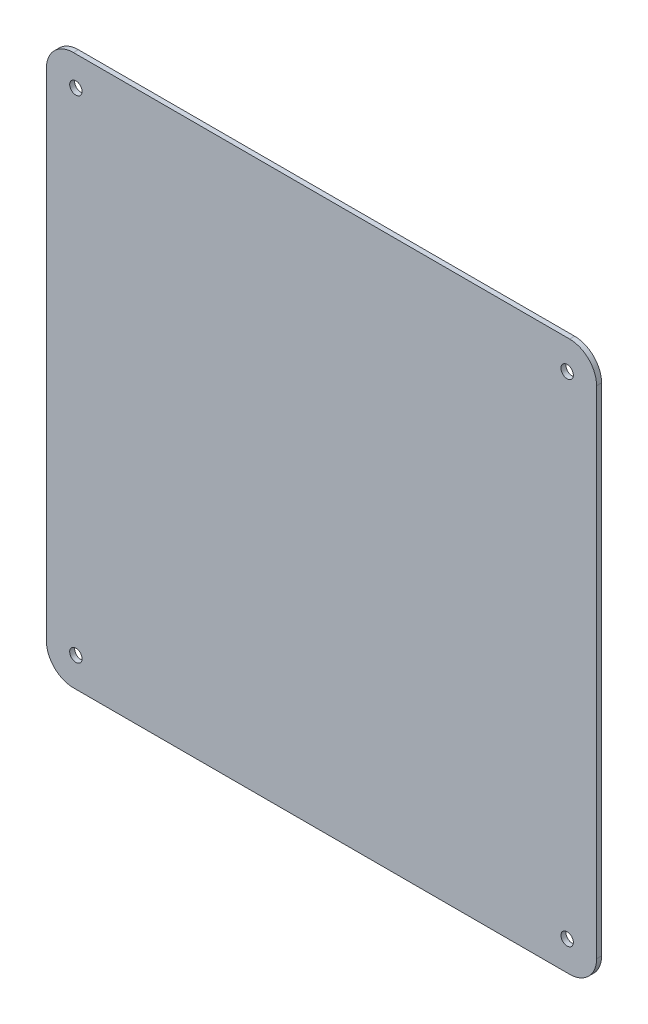
ISO-10303-21;
HEADER;
FILE_DESCRIPTION(('STEP AP214'),'2;1');
FILE_NAME('part.step','',(''),(''),'','','');
FILE_SCHEMA(('AUTOMOTIVE_DESIGN { 1 0 10303 214 1 1 1 1 }'));
ENDSEC;
DATA;
#1=APPLICATION_CONTEXT('core data for automotive mechanical design processes');
#2=APPLICATION_PROTOCOL_DEFINITION('international standard','automotive_design',2000,#1);
#3=PRODUCT_CONTEXT('',#1,'mechanical');
#4=PRODUCT('Part','Part','',(#3));
#5=PRODUCT_RELATED_PRODUCT_CATEGORY('part','',(#4));
#6=PRODUCT_DEFINITION_FORMATION('','',#4);
#7=PRODUCT_DEFINITION_CONTEXT('part definition',#1,'design');
#8=PRODUCT_DEFINITION('design','',#6,#7);
#9=PRODUCT_DEFINITION_SHAPE('','',#8);
#10=(LENGTH_UNIT() NAMED_UNIT(*) SI_UNIT(.MILLI.,.METRE.));
#11=(NAMED_UNIT(*) PLANE_ANGLE_UNIT() SI_UNIT($,.RADIAN.));
#12=(NAMED_UNIT(*) SI_UNIT($,.STERADIAN.) SOLID_ANGLE_UNIT());
#13=UNCERTAINTY_MEASURE_WITH_UNIT(LENGTH_MEASURE(1.E-05),#10,'distance_accuracy_value','');
#14=(GEOMETRIC_REPRESENTATION_CONTEXT(3) GLOBAL_UNCERTAINTY_ASSIGNED_CONTEXT((#13)) GLOBAL_UNIT_ASSIGNED_CONTEXT((#10,
#11,#12)) REPRESENTATION_CONTEXT('',''));
#15=CARTESIAN_POINT('',(0.,0.,0.));
#16=DIRECTION('',(0.,0.,1.));
#17=DIRECTION('',(1.,0.,0.));
#18=AXIS2_PLACEMENT_3D('',#15,#16,#17);
#19=CARTESIAN_POINT('',(-80.,80.,1.6));
#20=DIRECTION('',(0.,0.,-1.));
#21=DIRECTION('',(-1.,0.,0.));
#22=AXIS2_PLACEMENT_3D('',#19,#20,#21);
#23=CYLINDRICAL_SURFACE('',#22,8.70000000000002);
#24=CARTESIAN_POINT('',(-80.,80.,0.));
#25=DIRECTION('',(0.,0.,1.));
#26=DIRECTION('',(1.,0.,0.));
#27=AXIS2_PLACEMENT_3D('',#24,#25,#26);
#28=CIRCLE('',#27,8.70000000000002);
#29=CARTESIAN_POINT('',(-80.,88.7,0.));
#30=VERTEX_POINT('',#29);
#31=CARTESIAN_POINT('',(-88.7,80.,0.));
#32=VERTEX_POINT('',#31);
#33=EDGE_CURVE('E131',#30,#32,#28,.T.);
#34=ORIENTED_EDGE('',*,*,#33,.T.);
#35=DIRECTION('',(0.,0.,-1.));
#36=VECTOR('',#35,1.);
#37=CARTESIAN_POINT('',(-88.7,80.,1.6));
#38=LINE('',#37,#36);
#39=CARTESIAN_POINT('',(-88.7,80.,1.6));
#40=VERTEX_POINT('',#39);
#41=EDGE_CURVE('E11',#40,#32,#38,.T.);
#42=ORIENTED_EDGE('',*,*,#41,.F.);
#43=CARTESIAN_POINT('',(-80.,80.,1.6));
#44=DIRECTION('',(0.,0.,1.));
#45=DIRECTION('',(1.,0.,0.));
#46=AXIS2_PLACEMENT_3D('',#43,#44,#45);
#47=CIRCLE('',#46,8.70000000000002);
#48=CARTESIAN_POINT('',(-80.,88.7,1.6));
#49=VERTEX_POINT('',#48);
#50=EDGE_CURVE('E146',#49,#40,#47,.T.);
#51=ORIENTED_EDGE('',*,*,#50,.F.);
#52=DIRECTION('',(0.,0.,-1.));
#53=VECTOR('',#52,1.);
#54=CARTESIAN_POINT('',(-80.,88.7,1.6));
#55=LINE('',#54,#53);
#56=EDGE_CURVE('E127',#49,#30,#55,.T.);
#57=ORIENTED_EDGE('',*,*,#56,.T.);
#58=EDGE_LOOP('',(#34,#42,#51,#57));
#59=FACE_BOUND('',#58,.T.);
#60=ADVANCED_FACE('F35',(#59),#23,.T.);
#61=CARTESIAN_POINT('',(-88.7,-80.,1.6));
#62=DIRECTION('',(1.,0.,0.));
#63=DIRECTION('',(0.,0.,-1.));
#64=AXIS2_PLACEMENT_3D('',#61,#62,#63);
#65=PLANE('',#64);
#66=DIRECTION('',(0.,-1.,0.));
#67=VECTOR('',#66,1.);
#68=CARTESIAN_POINT('',(-88.7,-80.,0.));
#69=LINE('',#68,#67);
#70=CARTESIAN_POINT('',(-88.7,-80.,0.));
#71=VERTEX_POINT('',#70);
#72=EDGE_CURVE('E134',#32,#71,#69,.T.);
#73=ORIENTED_EDGE('',*,*,#72,.T.);
#74=DIRECTION('',(0.,0.,-1.));
#75=VECTOR('',#74,1.);
#76=CARTESIAN_POINT('',(-88.7,-80.,1.6));
#77=LINE('',#76,#75);
#78=CARTESIAN_POINT('',(-88.7,-80.,1.6));
#79=VERTEX_POINT('',#78);
#80=EDGE_CURVE('E43',#79,#71,#77,.T.);
#81=ORIENTED_EDGE('',*,*,#80,.F.);
#82=DIRECTION('',(0.,-1.,0.));
#83=VECTOR('',#82,1.);
#84=CARTESIAN_POINT('',(-88.7,-80.,1.6));
#85=LINE('',#84,#83);
#86=EDGE_CURVE('E94',#40,#79,#85,.T.);
#87=ORIENTED_EDGE('',*,*,#86,.F.);
#88=ORIENTED_EDGE('',*,*,#41,.T.);
#89=EDGE_LOOP('',(#73,#81,#87,#88));
#90=FACE_BOUND('',#89,.T.);
#91=ADVANCED_FACE('F228',(#90),#65,.F.);
#92=CARTESIAN_POINT('',(-80.,-80.,1.6));
#93=DIRECTION('',(0.,0.,-1.));
#94=DIRECTION('',(-1.,0.,0.));
#95=AXIS2_PLACEMENT_3D('',#92,#93,#94);
#96=CYLINDRICAL_SURFACE('',#95,8.70000000000001);
#97=CARTESIAN_POINT('',(-80.,-80.,0.));
#98=DIRECTION('',(0.,0.,1.));
#99=DIRECTION('',(1.,0.,0.));
#100=AXIS2_PLACEMENT_3D('',#97,#98,#99);
#101=CIRCLE('',#100,8.70000000000001);
#102=CARTESIAN_POINT('',(-80.,-88.7,0.));
#103=VERTEX_POINT('',#102);
#104=EDGE_CURVE('E137',#71,#103,#101,.T.);
#105=ORIENTED_EDGE('',*,*,#104,.T.);
#106=DIRECTION('',(0.,0.,-1.));
#107=VECTOR('',#106,1.);
#108=CARTESIAN_POINT('',(-80.,-88.7,1.6));
#109=LINE('',#108,#107);
#110=CARTESIAN_POINT('',(-80.,-88.7,1.6));
#111=VERTEX_POINT('',#110);
#112=EDGE_CURVE('E153',#111,#103,#109,.T.);
#113=ORIENTED_EDGE('',*,*,#112,.F.);
#114=CARTESIAN_POINT('',(-80.,-80.,1.6));
#115=DIRECTION('',(0.,0.,1.));
#116=DIRECTION('',(1.,0.,0.));
#117=AXIS2_PLACEMENT_3D('',#114,#115,#116);
#118=CIRCLE('',#117,8.70000000000001);
#119=EDGE_CURVE('E161',#79,#111,#118,.T.);
#120=ORIENTED_EDGE('',*,*,#119,.F.);
#121=ORIENTED_EDGE('',*,*,#80,.T.);
#122=EDGE_LOOP('',(#105,#113,#120,#121));
#123=FACE_BOUND('',#122,.T.);
#124=ADVANCED_FACE('F159',(#123),#96,.T.);
#125=CARTESIAN_POINT('',(80.,-88.7,1.6));
#126=DIRECTION('',(0.,1.,0.));
#127=DIRECTION('',(0.,0.,1.));
#128=AXIS2_PLACEMENT_3D('',#125,#126,#127);
#129=PLANE('',#128);
#130=DIRECTION('',(1.,0.,0.));
#131=VECTOR('',#130,1.);
#132=CARTESIAN_POINT('',(80.,-88.7,0.));
#133=LINE('',#132,#131);
#134=CARTESIAN_POINT('',(80.,-88.7,0.));
#135=VERTEX_POINT('',#134);
#136=EDGE_CURVE('E139',#103,#135,#133,.T.);
#137=ORIENTED_EDGE('',*,*,#136,.T.);
#138=DIRECTION('',(0.,0.,-1.));
#139=VECTOR('',#138,1.);
#140=CARTESIAN_POINT('',(80.,-88.7,1.6));
#141=LINE('',#140,#139);
#142=CARTESIAN_POINT('',(80.,-88.7,1.6));
#143=VERTEX_POINT('',#142);
#144=EDGE_CURVE('E150',#143,#135,#141,.T.);
#145=ORIENTED_EDGE('',*,*,#144,.F.);
#146=DIRECTION('',(1.,0.,0.));
#147=VECTOR('',#146,1.);
#148=CARTESIAN_POINT('',(80.,-88.7,1.6));
#149=LINE('',#148,#147);
#150=EDGE_CURVE('E173',#111,#143,#149,.T.);
#151=ORIENTED_EDGE('',*,*,#150,.F.);
#152=ORIENTED_EDGE('',*,*,#112,.T.);
#153=EDGE_LOOP('',(#137,#145,#151,#152));
#154=FACE_BOUND('',#153,.T.);
#155=ADVANCED_FACE('F169',(#154),#129,.F.);
#156=CARTESIAN_POINT('',(80.,-80.,1.6));
#157=DIRECTION('',(0.,0.,-1.));
#158=DIRECTION('',(-1.,0.,0.));
#159=AXIS2_PLACEMENT_3D('',#156,#157,#158);
#160=CYLINDRICAL_SURFACE('',#159,8.70000000000001);
#161=CARTESIAN_POINT('',(80.,-80.,0.));
#162=DIRECTION('',(0.,0.,1.));
#163=DIRECTION('',(1.,0.,0.));
#164=AXIS2_PLACEMENT_3D('',#161,#162,#163);
#165=CIRCLE('',#164,8.70000000000001);
#166=CARTESIAN_POINT('',(88.7,-80.,0.));
#167=VERTEX_POINT('',#166);
#168=EDGE_CURVE('E141',#135,#167,#165,.T.);
#169=ORIENTED_EDGE('',*,*,#168,.T.);
#170=DIRECTION('',(0.,0.,-1.));
#171=VECTOR('',#170,1.);
#172=CARTESIAN_POINT('',(88.7,-80.,1.6));
#173=LINE('',#172,#171);
#174=CARTESIAN_POINT('',(88.7,-80.,1.6));
#175=VERTEX_POINT('',#174);
#176=EDGE_CURVE('E122',#175,#167,#173,.T.);
#177=ORIENTED_EDGE('',*,*,#176,.F.);
#178=CARTESIAN_POINT('',(80.,-80.,1.6));
#179=DIRECTION('',(0.,0.,1.));
#180=DIRECTION('',(1.,0.,0.));
#181=AXIS2_PLACEMENT_3D('',#178,#179,#180);
#182=CIRCLE('',#181,8.70000000000001);
#183=EDGE_CURVE('E113',#143,#175,#182,.T.);
#184=ORIENTED_EDGE('',*,*,#183,.F.);
#185=ORIENTED_EDGE('',*,*,#144,.T.);
#186=EDGE_LOOP('',(#169,#177,#184,#185));
#187=FACE_BOUND('',#186,.T.);
#188=ADVANCED_FACE('F172',(#187),#160,.T.);
#189=CARTESIAN_POINT('',(88.7,80.,1.6));
#190=DIRECTION('',(-1.,0.,0.));
#191=DIRECTION('',(0.,0.,1.));
#192=AXIS2_PLACEMENT_3D('',#189,#190,#191);
#193=PLANE('',#192);
#194=DIRECTION('',(0.,1.,0.));
#195=VECTOR('',#194,1.);
#196=CARTESIAN_POINT('',(88.7,80.,0.));
#197=LINE('',#196,#195);
#198=CARTESIAN_POINT('',(88.7,80.,0.));
#199=VERTEX_POINT('',#198);
#200=EDGE_CURVE('E121',#167,#199,#197,.T.);
#201=ORIENTED_EDGE('',*,*,#200,.T.);
#202=DIRECTION('',(0.,0.,-1.));
#203=VECTOR('',#202,1.);
#204=CARTESIAN_POINT('',(88.7,80.,1.6));
#205=LINE('',#204,#203);
#206=CARTESIAN_POINT('',(88.7,80.,1.6));
#207=VERTEX_POINT('',#206);
#208=EDGE_CURVE('E118',#207,#199,#205,.T.);
#209=ORIENTED_EDGE('',*,*,#208,.F.);
#210=DIRECTION('',(0.,1.,0.));
#211=VECTOR('',#210,1.);
#212=CARTESIAN_POINT('',(88.7,80.,1.6));
#213=LINE('',#212,#211);
#214=EDGE_CURVE('E107',#175,#207,#213,.T.);
#215=ORIENTED_EDGE('',*,*,#214,.F.);
#216=ORIENTED_EDGE('',*,*,#176,.T.);
#217=EDGE_LOOP('',(#201,#209,#215,#216));
#218=FACE_BOUND('',#217,.T.);
#219=ADVANCED_FACE('F119',(#218),#193,.F.);
#220=CARTESIAN_POINT('',(80.,80.,1.6));
#221=DIRECTION('',(0.,0.,-1.));
#222=DIRECTION('',(-1.,0.,0.));
#223=AXIS2_PLACEMENT_3D('',#220,#221,#222);
#224=CYLINDRICAL_SURFACE('',#223,8.70000000000001);
#225=CARTESIAN_POINT('',(80.,80.,0.));
#226=DIRECTION('',(0.,0.,1.));
#227=DIRECTION('',(1.,0.,0.));
#228=AXIS2_PLACEMENT_3D('',#225,#226,#227);
#229=CIRCLE('',#228,8.70000000000001);
#230=CARTESIAN_POINT('',(80.,88.7,0.));
#231=VERTEX_POINT('',#230);
#232=EDGE_CURVE('E80',#199,#231,#229,.T.);
#233=ORIENTED_EDGE('',*,*,#232,.T.);
#234=DIRECTION('',(0.,0.,-1.));
#235=VECTOR('',#234,1.);
#236=CARTESIAN_POINT('',(80.,88.7,1.6));
#237=LINE('',#236,#235);
#238=CARTESIAN_POINT('',(80.,88.7,1.6));
#239=VERTEX_POINT('',#238);
#240=EDGE_CURVE('E123',#239,#231,#237,.T.);
#241=ORIENTED_EDGE('',*,*,#240,.F.);
#242=CARTESIAN_POINT('',(80.,80.,1.6));
#243=DIRECTION('',(0.,0.,1.));
#244=DIRECTION('',(1.,0.,0.));
#245=AXIS2_PLACEMENT_3D('',#242,#243,#244);
#246=CIRCLE('',#245,8.70000000000001);
#247=EDGE_CURVE('E111',#207,#239,#246,.T.);
#248=ORIENTED_EDGE('',*,*,#247,.F.);
#249=ORIENTED_EDGE('',*,*,#208,.T.);
#250=EDGE_LOOP('',(#233,#241,#248,#249));
#251=FACE_BOUND('',#250,.T.);
#252=ADVANCED_FACE('F125',(#251),#224,.T.);
#253=CARTESIAN_POINT('',(-80.,88.7,1.6));
#254=DIRECTION('',(0.,-1.,0.));
#255=DIRECTION('',(0.,0.,-1.));
#256=AXIS2_PLACEMENT_3D('',#253,#254,#255);
#257=PLANE('',#256);
#258=DIRECTION('',(-1.,0.,0.));
#259=VECTOR('',#258,1.);
#260=CARTESIAN_POINT('',(-80.,88.7,0.));
#261=LINE('',#260,#259);
#262=EDGE_CURVE('E86',#231,#30,#261,.T.);
#263=ORIENTED_EDGE('',*,*,#262,.T.);
#264=ORIENTED_EDGE('',*,*,#56,.F.);
#265=DIRECTION('',(-1.,0.,0.));
#266=VECTOR('',#265,1.);
#267=CARTESIAN_POINT('',(-80.,88.7,1.6));
#268=LINE('',#267,#266);
#269=EDGE_CURVE('E51',#239,#49,#268,.T.);
#270=ORIENTED_EDGE('',*,*,#269,.F.);
#271=ORIENTED_EDGE('',*,*,#240,.T.);
#272=EDGE_LOOP('',(#263,#264,#270,#271));
#273=FACE_BOUND('',#272,.T.);
#274=ADVANCED_FACE('F235',(#273),#257,.F.);
#275=CARTESIAN_POINT('',(-80.,80.,1.6));
#276=DIRECTION('',(0.,0.,1.));
#277=DIRECTION('',(1.,0.,0.));
#278=AXIS2_PLACEMENT_3D('',#275,#276,#277);
#279=PLANE('',#278);
#280=CARTESIAN_POINT('',(79.2,79.2,1.6));
#281=DIRECTION('',(0.,0.,-1.));
#282=DIRECTION('',(-1.,0.,0.));
#283=AXIS2_PLACEMENT_3D('',#280,#281,#282);
#284=CIRCLE('',#283,2.);
#285=CARTESIAN_POINT('',(77.2,79.2,1.6));
#286=VERTEX_POINT('',#285);
#287=EDGE_CURVE('E196',#286,#286,#284,.T.);
#288=ORIENTED_EDGE('',*,*,#287,.T.);
#289=EDGE_LOOP('',(#288));
#290=FACE_BOUND('',#289,.T.);
#291=CARTESIAN_POINT('',(-79.2,79.2,1.6));
#292=DIRECTION('',(0.,0.,-1.));
#293=DIRECTION('',(-1.,0.,0.));
#294=AXIS2_PLACEMENT_3D('',#291,#292,#293);
#295=CIRCLE('',#294,2.);
#296=CARTESIAN_POINT('',(-81.2,79.2,1.6));
#297=VERTEX_POINT('',#296);
#298=EDGE_CURVE('E190',#297,#297,#295,.T.);
#299=ORIENTED_EDGE('',*,*,#298,.T.);
#300=EDGE_LOOP('',(#299));
#301=FACE_BOUND('',#300,.T.);
#302=CARTESIAN_POINT('',(79.2,-79.2,1.6));
#303=DIRECTION('',(0.,0.,-1.));
#304=DIRECTION('',(-1.,0.,0.));
#305=AXIS2_PLACEMENT_3D('',#302,#303,#304);
#306=CIRCLE('',#305,2.);
#307=CARTESIAN_POINT('',(77.2,-79.2,1.6));
#308=VERTEX_POINT('',#307);
#309=EDGE_CURVE('E184',#308,#308,#306,.T.);
#310=ORIENTED_EDGE('',*,*,#309,.T.);
#311=EDGE_LOOP('',(#310));
#312=FACE_BOUND('',#311,.T.);
#313=CARTESIAN_POINT('',(-79.2,-79.2,1.6));
#314=DIRECTION('',(0.,0.,-1.));
#315=DIRECTION('',(-1.,0.,0.));
#316=AXIS2_PLACEMENT_3D('',#313,#314,#315);
#317=CIRCLE('',#316,2.);
#318=CARTESIAN_POINT('',(-81.2,-79.2,1.6));
#319=VERTEX_POINT('',#318);
#320=EDGE_CURVE('E135',#319,#319,#317,.T.);
#321=ORIENTED_EDGE('',*,*,#320,.T.);
#322=EDGE_LOOP('',(#321));
#323=FACE_BOUND('',#322,.T.);
#324=ORIENTED_EDGE('',*,*,#50,.T.);
#325=ORIENTED_EDGE('',*,*,#86,.T.);
#326=ORIENTED_EDGE('',*,*,#119,.T.);
#327=ORIENTED_EDGE('',*,*,#150,.T.);
#328=ORIENTED_EDGE('',*,*,#183,.T.);
#329=ORIENTED_EDGE('',*,*,#214,.T.);
#330=ORIENTED_EDGE('',*,*,#247,.T.);
#331=ORIENTED_EDGE('',*,*,#269,.T.);
#332=EDGE_LOOP('',(#324,#325,#326,#327,#328,#329,#330,#331));
#333=FACE_BOUND('',#332,.T.);
#334=ADVANCED_FACE('F109',(#290,#301,#312,#323,#333),#279,.T.);
#335=CARTESIAN_POINT('',(-80.,80.,0.));
#336=DIRECTION('',(0.,0.,1.));
#337=DIRECTION('',(1.,0.,0.));
#338=AXIS2_PLACEMENT_3D('',#335,#336,#337);
#339=PLANE('',#338);
#340=CARTESIAN_POINT('',(79.2,79.2,0.));
#341=DIRECTION('',(0.,0.,-1.));
#342=DIRECTION('',(-1.,0.,0.));
#343=AXIS2_PLACEMENT_3D('',#340,#341,#342);
#344=CIRCLE('',#343,1.99999999999999);
#345=CARTESIAN_POINT('',(77.2000000000001,79.2,0.));
#346=VERTEX_POINT('',#345);
#347=EDGE_CURVE('E199',#346,#346,#344,.T.);
#348=ORIENTED_EDGE('',*,*,#347,.F.);
#349=EDGE_LOOP('',(#348));
#350=FACE_BOUND('',#349,.T.);
#351=CARTESIAN_POINT('',(-79.2,79.2,0.));
#352=DIRECTION('',(0.,0.,-1.));
#353=DIRECTION('',(-1.,0.,0.));
#354=AXIS2_PLACEMENT_3D('',#351,#352,#353);
#355=CIRCLE('',#354,1.99999999999999);
#356=CARTESIAN_POINT('',(-81.2,79.2,0.));
#357=VERTEX_POINT('',#356);
#358=EDGE_CURVE('E193',#357,#357,#355,.T.);
#359=ORIENTED_EDGE('',*,*,#358,.F.);
#360=EDGE_LOOP('',(#359));
#361=FACE_BOUND('',#360,.T.);
#362=CARTESIAN_POINT('',(79.2,-79.2,0.));
#363=DIRECTION('',(0.,0.,-1.));
#364=DIRECTION('',(-1.,0.,0.));
#365=AXIS2_PLACEMENT_3D('',#362,#363,#364);
#366=CIRCLE('',#365,1.99999999999999);
#367=CARTESIAN_POINT('',(77.2000000000001,-79.2,0.));
#368=VERTEX_POINT('',#367);
#369=EDGE_CURVE('E187',#368,#368,#366,.T.);
#370=ORIENTED_EDGE('',*,*,#369,.F.);
#371=EDGE_LOOP('',(#370));
#372=FACE_BOUND('',#371,.T.);
#373=CARTESIAN_POINT('',(-79.2,-79.2,0.));
#374=DIRECTION('',(0.,0.,-1.));
#375=DIRECTION('',(-1.,0.,0.));
#376=AXIS2_PLACEMENT_3D('',#373,#374,#375);
#377=CIRCLE('',#376,1.99999999999999);
#378=CARTESIAN_POINT('',(-81.2,-79.2,0.));
#379=VERTEX_POINT('',#378);
#380=EDGE_CURVE('E181',#379,#379,#377,.T.);
#381=ORIENTED_EDGE('',*,*,#380,.F.);
#382=EDGE_LOOP('',(#381));
#383=FACE_BOUND('',#382,.T.);
#384=ORIENTED_EDGE('',*,*,#33,.F.);
#385=ORIENTED_EDGE('',*,*,#262,.F.);
#386=ORIENTED_EDGE('',*,*,#232,.F.);
#387=ORIENTED_EDGE('',*,*,#200,.F.);
#388=ORIENTED_EDGE('',*,*,#168,.F.);
#389=ORIENTED_EDGE('',*,*,#136,.F.);
#390=ORIENTED_EDGE('',*,*,#104,.F.);
#391=ORIENTED_EDGE('',*,*,#72,.F.);
#392=EDGE_LOOP('',(#384,#385,#386,#387,#388,#389,#390,#391));
#393=FACE_BOUND('',#392,.T.);
#394=ADVANCED_FACE('F165',(#350,#361,#372,#383,#393),#339,.F.);
#395=CARTESIAN_POINT('',(-79.2,-79.2,0.));
#396=DIRECTION('',(0.,0.,-1.));
#397=DIRECTION('',(-1.,0.,0.));
#398=AXIS2_PLACEMENT_3D('',#395,#396,#397);
#399=CYLINDRICAL_SURFACE('',#398,1.99999999999999);
#400=ORIENTED_EDGE('',*,*,#320,.F.);
#401=EDGE_LOOP('',(#400));
#402=FACE_BOUND('',#401,.T.);
#403=ORIENTED_EDGE('',*,*,#380,.T.);
#404=EDGE_LOOP('',(#403));
#405=FACE_BOUND('',#404,.T.);
#406=ADVANCED_FACE('F207',(#402,#405),#399,.F.);
#407=CARTESIAN_POINT('',(79.2,-79.2,0.));
#408=DIRECTION('',(0.,0.,-1.));
#409=DIRECTION('',(-1.,0.,0.));
#410=AXIS2_PLACEMENT_3D('',#407,#408,#409);
#411=CYLINDRICAL_SURFACE('',#410,1.99999999999999);
#412=ORIENTED_EDGE('',*,*,#309,.F.);
#413=EDGE_LOOP('',(#412));
#414=FACE_BOUND('',#413,.T.);
#415=ORIENTED_EDGE('',*,*,#369,.T.);
#416=EDGE_LOOP('',(#415));
#417=FACE_BOUND('',#416,.T.);
#418=ADVANCED_FACE('F216',(#414,#417),#411,.F.);
#419=CARTESIAN_POINT('',(-79.2,79.2,0.));
#420=DIRECTION('',(0.,0.,-1.));
#421=DIRECTION('',(-1.,0.,0.));
#422=AXIS2_PLACEMENT_3D('',#419,#420,#421);
#423=CYLINDRICAL_SURFACE('',#422,1.99999999999999);
#424=ORIENTED_EDGE('',*,*,#298,.F.);
#425=EDGE_LOOP('',(#424));
#426=FACE_BOUND('',#425,.T.);
#427=ORIENTED_EDGE('',*,*,#358,.T.);
#428=EDGE_LOOP('',(#427));
#429=FACE_BOUND('',#428,.T.);
#430=ADVANCED_FACE('F222',(#426,#429),#423,.F.);
#431=CARTESIAN_POINT('',(79.2,79.2,0.));
#432=DIRECTION('',(0.,0.,-1.));
#433=DIRECTION('',(-1.,0.,0.));
#434=AXIS2_PLACEMENT_3D('',#431,#432,#433);
#435=CYLINDRICAL_SURFACE('',#434,1.99999999999999);
#436=ORIENTED_EDGE('',*,*,#287,.F.);
#437=EDGE_LOOP('',(#436));
#438=FACE_BOUND('',#437,.T.);
#439=ORIENTED_EDGE('',*,*,#347,.T.);
#440=EDGE_LOOP('',(#439));
#441=FACE_BOUND('',#440,.T.);
#442=ADVANCED_FACE('F203',(#438,#441),#435,.F.);
#443=CLOSED_SHELL('',(#60,#91,#124,#155,#188,#219,#252,#274,#334,#394,#406,#418,#430,#442));
#444=MANIFOLD_SOLID_BREP('B2',#443);
#445=ADVANCED_BREP_SHAPE_REPRESENTATION('',(#18,#444),#14);
#446=SHAPE_DEFINITION_REPRESENTATION(#9,#445);
ENDSEC;
END-ISO-10303-21;
